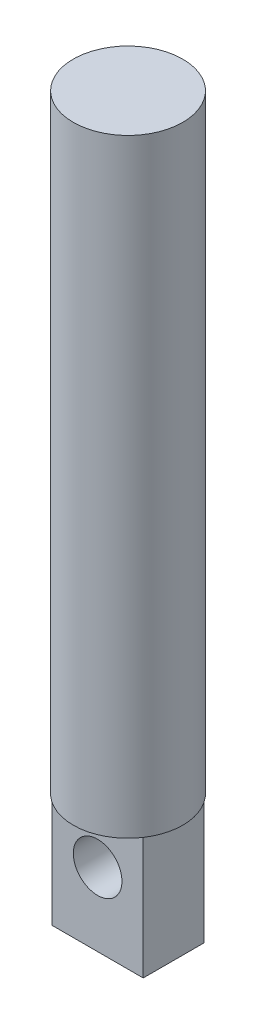
ISO-10303-21;
HEADER;
FILE_DESCRIPTION(('STEP AP214'),'2;1');
FILE_NAME('part.step','',(''),(''),'','','');
FILE_SCHEMA(('AUTOMOTIVE_DESIGN { 1 0 10303 214 1 1 1 1 }'));
ENDSEC;
DATA;
#1=APPLICATION_CONTEXT('core data for automotive mechanical design processes');
#2=APPLICATION_PROTOCOL_DEFINITION('international standard','automotive_design',2000,#1);
#3=PRODUCT_CONTEXT('',#1,'mechanical');
#4=PRODUCT('Part','Part','',(#3));
#5=PRODUCT_RELATED_PRODUCT_CATEGORY('part','',(#4));
#6=PRODUCT_DEFINITION_FORMATION('','',#4);
#7=PRODUCT_DEFINITION_CONTEXT('part definition',#1,'design');
#8=PRODUCT_DEFINITION('design','',#6,#7);
#9=PRODUCT_DEFINITION_SHAPE('','',#8);
#10=(LENGTH_UNIT() NAMED_UNIT(*) SI_UNIT(.MILLI.,.METRE.));
#11=(NAMED_UNIT(*) PLANE_ANGLE_UNIT() SI_UNIT($,.RADIAN.));
#12=(NAMED_UNIT(*) SI_UNIT($,.STERADIAN.) SOLID_ANGLE_UNIT());
#13=UNCERTAINTY_MEASURE_WITH_UNIT(LENGTH_MEASURE(1.E-05),#10,'distance_accuracy_value','');
#14=(GEOMETRIC_REPRESENTATION_CONTEXT(3) GLOBAL_UNCERTAINTY_ASSIGNED_CONTEXT((#13)) GLOBAL_UNIT_ASSIGNED_CONTEXT((#10,
#11,#12)) REPRESENTATION_CONTEXT('',''));
#15=CARTESIAN_POINT('',(0.,0.,0.));
#16=DIRECTION('',(0.,0.,1.));
#17=DIRECTION('',(1.,0.,0.));
#18=AXIS2_PLACEMENT_3D('',#15,#16,#17);
#19=CARTESIAN_POINT('',(0.,0.,0.));
#20=DIRECTION('',(0.,1.,0.));
#21=DIRECTION('',(0.,0.,1.));
#22=AXIS2_PLACEMENT_3D('',#19,#20,#21);
#23=PLANE('',#22);
#24=DIRECTION('',(0.,0.,-1.));
#25=VECTOR('',#24,1.);
#26=CARTESIAN_POINT('',(-3.74422631451587,0.,-2.49615089802017));
#27=LINE('',#26,#25);
#28=CARTESIAN_POINT('',(-3.74422631451587,0.,2.49615089802017));
#29=VERTEX_POINT('',#28);
#30=CARTESIAN_POINT('',(-3.74422631451587,0.,-2.49615089802017));
#31=VERTEX_POINT('',#30);
#32=EDGE_CURVE('E55',#29,#31,#27,.T.);
#33=ORIENTED_EDGE('',*,*,#32,.F.);
#34=CARTESIAN_POINT('',(0.,0.,0.));
#35=DIRECTION('',(0.,1.,0.));
#36=DIRECTION('',(0.,0.,1.));
#37=AXIS2_PLACEMENT_3D('',#34,#35,#36);
#38=CIRCLE('',#37,4.5);
#39=EDGE_CURVE('E108',#31,#29,#38,.T.);
#40=ORIENTED_EDGE('',*,*,#39,.F.);
#41=EDGE_LOOP('',(#33,#40));
#42=FACE_BOUND('',#41,.T.);
#43=ADVANCED_FACE('F39',(#42),#23,.F.);
#44=DIRECTION('',(-1.,0.,0.));
#45=VECTOR('',#44,1.);
#46=CARTESIAN_POINT('',(3.74422631451587,0.,2.49615089802017));
#47=LINE('',#46,#45);
#48=CARTESIAN_POINT('',(3.74422631451587,0.,2.49615089802017));
#49=VERTEX_POINT('',#48);
#50=EDGE_CURVE('E102',#49,#29,#47,.T.);
#51=ORIENTED_EDGE('',*,*,#50,.F.);
#52=EDGE_CURVE('E105',#29,#49,#38,.T.);
#53=ORIENTED_EDGE('',*,*,#52,.F.);
#54=EDGE_LOOP('',(#51,#53));
#55=FACE_BOUND('',#54,.T.);
#56=ADVANCED_FACE('F151',(#55),#23,.F.);
#57=DIRECTION('',(0.,0.,1.));
#58=VECTOR('',#57,1.);
#59=CARTESIAN_POINT('',(3.74422631451587,0.,-2.49615089802017));
#60=LINE('',#59,#58);
#61=CARTESIAN_POINT('',(3.74422631451587,0.,-2.49615089802017));
#62=VERTEX_POINT('',#61);
#63=EDGE_CURVE('E124',#62,#49,#60,.T.);
#64=ORIENTED_EDGE('',*,*,#63,.F.);
#65=EDGE_CURVE('E48',#49,#62,#38,.T.);
#66=ORIENTED_EDGE('',*,*,#65,.F.);
#67=EDGE_LOOP('',(#64,#66));
#68=FACE_BOUND('',#67,.T.);
#69=ADVANCED_FACE('F157',(#68),#23,.F.);
#70=DIRECTION('',(1.,0.,0.));
#71=VECTOR('',#70,1.);
#72=CARTESIAN_POINT('',(3.74422631451587,0.,-2.49615089802017));
#73=LINE('',#72,#71);
#74=EDGE_CURVE('E62',#31,#62,#73,.T.);
#75=ORIENTED_EDGE('',*,*,#74,.F.);
#76=EDGE_CURVE('E112',#62,#31,#38,.T.);
#77=ORIENTED_EDGE('',*,*,#76,.F.);
#78=EDGE_LOOP('',(#75,#77));
#79=FACE_BOUND('',#78,.T.);
#80=ADVANCED_FACE('F152',(#79),#23,.F.);
#81=CARTESIAN_POINT('',(0.,50.,0.));
#82=DIRECTION('',(0.,-1.,0.));
#83=DIRECTION('',(0.,0.,-1.));
#84=AXIS2_PLACEMENT_3D('',#81,#82,#83);
#85=CYLINDRICAL_SURFACE('',#84,4.5);
#86=CARTESIAN_POINT('',(0.,50.,0.));
#87=DIRECTION('',(0.,1.,0.));
#88=DIRECTION('',(0.,0.,1.));
#89=AXIS2_PLACEMENT_3D('',#86,#87,#88);
#90=CIRCLE('',#89,4.5);
#91=CARTESIAN_POINT('',(0.,50.,4.5));
#92=VERTEX_POINT('',#91);
#93=EDGE_CURVE('E11',#92,#92,#90,.T.);
#94=ORIENTED_EDGE('',*,*,#93,.F.);
#95=EDGE_LOOP('',(#94));
#96=FACE_BOUND('',#95,.T.);
#97=ORIENTED_EDGE('',*,*,#65,.T.);
#98=ORIENTED_EDGE('',*,*,#76,.T.);
#99=ORIENTED_EDGE('',*,*,#39,.T.);
#100=ORIENTED_EDGE('',*,*,#52,.T.);
#101=EDGE_LOOP('',(#97,#98,#99,#100));
#102=FACE_BOUND('',#101,.T.);
#103=ADVANCED_FACE('F41',(#96,#102),#85,.T.);
#104=CARTESIAN_POINT('',(0.,50.,0.));
#105=DIRECTION('',(0.,1.,0.));
#106=DIRECTION('',(0.,0.,1.));
#107=AXIS2_PLACEMENT_3D('',#104,#105,#106);
#108=PLANE('',#107);
#109=ORIENTED_EDGE('',*,*,#93,.T.);
#110=EDGE_LOOP('',(#109));
#111=FACE_BOUND('',#110,.T.);
#112=ADVANCED_FACE('F164',(#111),#108,.T.);
#113=CARTESIAN_POINT('',(-3.74422631451587,-10.,-2.49615089802017));
#114=DIRECTION('',(1.,0.,0.));
#115=DIRECTION('',(0.,0.,-1.));
#116=AXIS2_PLACEMENT_3D('',#113,#114,#115);
#117=PLANE('',#116);
#118=ORIENTED_EDGE('',*,*,#32,.T.);
#119=DIRECTION('',(0.,1.,0.));
#120=VECTOR('',#119,1.);
#121=CARTESIAN_POINT('',(-3.74422631451587,-10.,-2.49615089802017));
#122=LINE('',#121,#120);
#123=CARTESIAN_POINT('',(-3.74422631451587,-10.,-2.49615089802017));
#124=VERTEX_POINT('',#123);
#125=EDGE_CURVE('E87',#124,#31,#122,.T.);
#126=ORIENTED_EDGE('',*,*,#125,.F.);
#127=DIRECTION('',(0.,0.,-1.));
#128=VECTOR('',#127,1.);
#129=CARTESIAN_POINT('',(-3.74422631451587,-10.,-2.49615089802017));
#130=LINE('',#129,#128);
#131=CARTESIAN_POINT('',(-3.74422631451587,-10.,2.49615089802017));
#132=VERTEX_POINT('',#131);
#133=EDGE_CURVE('E93',#132,#124,#130,.T.);
#134=ORIENTED_EDGE('',*,*,#133,.F.);
#135=DIRECTION('',(0.,1.,0.));
#136=VECTOR('',#135,1.);
#137=CARTESIAN_POINT('',(-3.74422631451587,-10.,2.49615089802017));
#138=LINE('',#137,#136);
#139=EDGE_CURVE('E121',#132,#29,#138,.T.);
#140=ORIENTED_EDGE('',*,*,#139,.T.);
#141=EDGE_LOOP('',(#118,#126,#134,#140));
#142=FACE_BOUND('',#141,.T.);
#143=ADVANCED_FACE('F104',(#142),#117,.F.);
#144=CARTESIAN_POINT('',(3.74422631451587,-10.,-2.49615089802017));
#145=DIRECTION('',(0.,0.,1.));
#146=DIRECTION('',(1.,0.,0.));
#147=AXIS2_PLACEMENT_3D('',#144,#145,#146);
#148=PLANE('',#147);
#149=CARTESIAN_POINT('',(0.,-4.,-2.49615089802017));
#150=DIRECTION('',(0.,0.,-1.));
#151=DIRECTION('',(-1.,0.,0.));
#152=AXIS2_PLACEMENT_3D('',#149,#150,#151);
#153=CIRCLE('',#152,2.);
#154=CARTESIAN_POINT('',(-2.,-4.,-2.49615089802017));
#155=VERTEX_POINT('',#154);
#156=EDGE_CURVE('E134',#155,#155,#153,.T.);
#157=ORIENTED_EDGE('',*,*,#156,.F.);
#158=EDGE_LOOP('',(#157));
#159=FACE_BOUND('',#158,.T.);
#160=ORIENTED_EDGE('',*,*,#74,.T.);
#161=DIRECTION('',(0.,1.,0.));
#162=VECTOR('',#161,1.);
#163=CARTESIAN_POINT('',(3.74422631451587,-10.,-2.49615089802017));
#164=LINE('',#163,#162);
#165=CARTESIAN_POINT('',(3.74422631451587,-10.,-2.49615089802017));
#166=VERTEX_POINT('',#165);
#167=EDGE_CURVE('E89',#166,#62,#164,.T.);
#168=ORIENTED_EDGE('',*,*,#167,.F.);
#169=DIRECTION('',(1.,0.,0.));
#170=VECTOR('',#169,1.);
#171=CARTESIAN_POINT('',(3.74422631451587,-10.,-2.49615089802017));
#172=LINE('',#171,#170);
#173=EDGE_CURVE('E83',#124,#166,#172,.T.);
#174=ORIENTED_EDGE('',*,*,#173,.F.);
#175=ORIENTED_EDGE('',*,*,#125,.T.);
#176=EDGE_LOOP('',(#160,#168,#174,#175));
#177=FACE_BOUND('',#176,.T.);
#178=ADVANCED_FACE('F85',(#159,#177),#148,.F.);
#179=CARTESIAN_POINT('',(3.74422631451587,-10.,-2.49615089802017));
#180=DIRECTION('',(-1.,0.,0.));
#181=DIRECTION('',(0.,0.,1.));
#182=AXIS2_PLACEMENT_3D('',#179,#180,#181);
#183=PLANE('',#182);
#184=ORIENTED_EDGE('',*,*,#63,.T.);
#185=DIRECTION('',(0.,1.,0.));
#186=VECTOR('',#185,1.);
#187=CARTESIAN_POINT('',(3.74422631451587,-10.,2.49615089802017));
#188=LINE('',#187,#186);
#189=CARTESIAN_POINT('',(3.74422631451587,-10.,2.49615089802017));
#190=VERTEX_POINT('',#189);
#191=EDGE_CURVE('E109',#190,#49,#188,.T.);
#192=ORIENTED_EDGE('',*,*,#191,.F.);
#193=DIRECTION('',(0.,0.,1.));
#194=VECTOR('',#193,1.);
#195=CARTESIAN_POINT('',(3.74422631451587,-10.,-2.49615089802017));
#196=LINE('',#195,#194);
#197=EDGE_CURVE('E92',#166,#190,#196,.T.);
#198=ORIENTED_EDGE('',*,*,#197,.F.);
#199=ORIENTED_EDGE('',*,*,#167,.T.);
#200=EDGE_LOOP('',(#184,#192,#198,#199));
#201=FACE_BOUND('',#200,.T.);
#202=ADVANCED_FACE('F171',(#201),#183,.F.);
#203=CARTESIAN_POINT('',(3.74422631451587,-10.,2.49615089802017));
#204=DIRECTION('',(0.,0.,-1.));
#205=DIRECTION('',(-1.,0.,0.));
#206=AXIS2_PLACEMENT_3D('',#203,#204,#205);
#207=PLANE('',#206);
#208=CARTESIAN_POINT('',(0.,-4.,2.49615089802017));
#209=DIRECTION('',(0.,0.,-1.));
#210=DIRECTION('',(-1.,0.,0.));
#211=AXIS2_PLACEMENT_3D('',#208,#209,#210);
#212=CIRCLE('',#211,2.);
#213=CARTESIAN_POINT('',(-2.,-4.,2.49615089802017));
#214=VERTEX_POINT('',#213);
#215=EDGE_CURVE('E43',#214,#214,#212,.T.);
#216=ORIENTED_EDGE('',*,*,#215,.T.);
#217=EDGE_LOOP('',(#216));
#218=FACE_BOUND('',#217,.T.);
#219=ORIENTED_EDGE('',*,*,#50,.T.);
#220=ORIENTED_EDGE('',*,*,#139,.F.);
#221=DIRECTION('',(-1.,0.,0.));
#222=VECTOR('',#221,1.);
#223=CARTESIAN_POINT('',(3.74422631451587,-10.,2.49615089802017));
#224=LINE('',#223,#222);
#225=EDGE_CURVE('E98',#190,#132,#224,.T.);
#226=ORIENTED_EDGE('',*,*,#225,.F.);
#227=ORIENTED_EDGE('',*,*,#191,.T.);
#228=EDGE_LOOP('',(#219,#220,#226,#227));
#229=FACE_BOUND('',#228,.T.);
#230=ADVANCED_FACE('F120',(#218,#229),#207,.F.);
#231=CARTESIAN_POINT('',(0.,-10.,0.));
#232=DIRECTION('',(0.,-1.,0.));
#233=DIRECTION('',(0.,0.,-1.));
#234=AXIS2_PLACEMENT_3D('',#231,#232,#233);
#235=PLANE('',#234);
#236=ORIENTED_EDGE('',*,*,#133,.T.);
#237=ORIENTED_EDGE('',*,*,#173,.T.);
#238=ORIENTED_EDGE('',*,*,#197,.T.);
#239=ORIENTED_EDGE('',*,*,#225,.T.);
#240=EDGE_LOOP('',(#236,#237,#238,#239));
#241=FACE_BOUND('',#240,.T.);
#242=ADVANCED_FACE('F96',(#241),#235,.T.);
#243=CARTESIAN_POINT('',(0.,-4.,7.50384910197983));
#244=DIRECTION('',(0.,0.,-1.));
#245=DIRECTION('',(-1.,0.,0.));
#246=AXIS2_PLACEMENT_3D('',#243,#244,#245);
#247=CYLINDRICAL_SURFACE('',#246,2.);
#248=ORIENTED_EDGE('',*,*,#156,.T.);
#249=EDGE_LOOP('',(#248));
#250=FACE_BOUND('',#249,.T.);
#251=ORIENTED_EDGE('',*,*,#215,.F.);
#252=EDGE_LOOP('',(#251));
#253=FACE_BOUND('',#252,.T.);
#254=ADVANCED_FACE('F142',(#250,#253),#247,.F.);
#255=CLOSED_SHELL('',(#43,#56,#69,#80,#103,#112,#143,#178,#202,#230,#242,#254));
#256=MANIFOLD_SOLID_BREP('B2',#255);
#257=ADVANCED_BREP_SHAPE_REPRESENTATION('',(#18,#256),#14);
#258=SHAPE_DEFINITION_REPRESENTATION(#9,#257);
ENDSEC;
END-ISO-10303-21;
